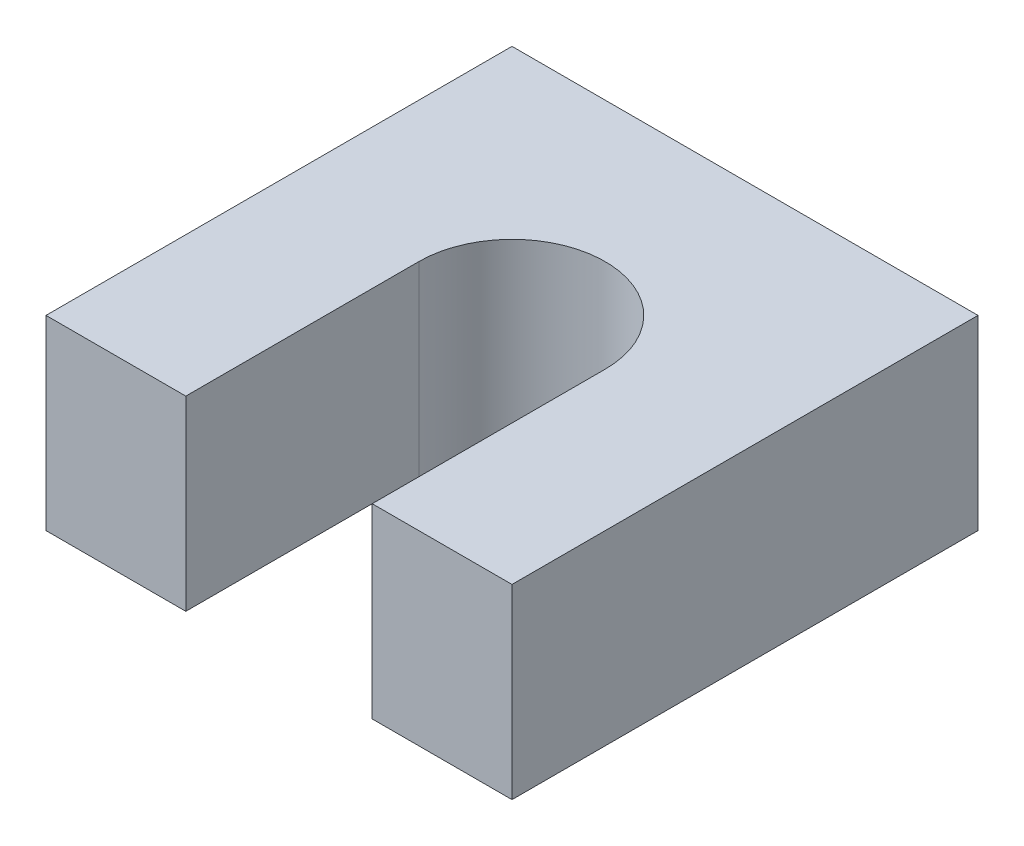
ISO-10303-21;
HEADER;
FILE_DESCRIPTION(('STEP AP214'),'2;1');
FILE_NAME('part.step','',(''),(''),'','','');
FILE_SCHEMA(('AUTOMOTIVE_DESIGN { 1 0 10303 214 1 1 1 1 }'));
ENDSEC;
DATA;
#1=APPLICATION_CONTEXT('core data for automotive mechanical design processes');
#2=APPLICATION_PROTOCOL_DEFINITION('international standard','automotive_design',2000,#1);
#3=PRODUCT_CONTEXT('',#1,'mechanical');
#4=PRODUCT('Part','Part','',(#3));
#5=PRODUCT_RELATED_PRODUCT_CATEGORY('part','',(#4));
#6=PRODUCT_DEFINITION_FORMATION('','',#4);
#7=PRODUCT_DEFINITION_CONTEXT('part definition',#1,'design');
#8=PRODUCT_DEFINITION('design','',#6,#7);
#9=PRODUCT_DEFINITION_SHAPE('','',#8);
#10=(LENGTH_UNIT() NAMED_UNIT(*) SI_UNIT(.MILLI.,.METRE.));
#11=(NAMED_UNIT(*) PLANE_ANGLE_UNIT() SI_UNIT($,.RADIAN.));
#12=(NAMED_UNIT(*) SI_UNIT($,.STERADIAN.) SOLID_ANGLE_UNIT());
#13=UNCERTAINTY_MEASURE_WITH_UNIT(LENGTH_MEASURE(1.E-05),#10,'distance_accuracy_value','');
#14=(GEOMETRIC_REPRESENTATION_CONTEXT(3) GLOBAL_UNCERTAINTY_ASSIGNED_CONTEXT((#13)) GLOBAL_UNIT_ASSIGNED_CONTEXT((#10,
#11,#12)) REPRESENTATION_CONTEXT('',''));
#15=CARTESIAN_POINT('',(0.,0.,0.));
#16=DIRECTION('',(0.,0.,1.));
#17=DIRECTION('',(1.,0.,0.));
#18=AXIS2_PLACEMENT_3D('',#15,#16,#17);
#19=CARTESIAN_POINT('',(0.,10.16,0.));
#20=DIRECTION('',(0.,-1.,0.));
#21=DIRECTION('',(0.,0.,-1.));
#22=AXIS2_PLACEMENT_3D('',#19,#20,#21);
#23=CYLINDRICAL_SURFACE('',#22,5.08);
#24=CARTESIAN_POINT('',(0.,0.,0.));
#25=DIRECTION('',(0.,1.,0.));
#26=DIRECTION('',(0.,0.,1.));
#27=AXIS2_PLACEMENT_3D('',#24,#25,#26);
#28=CIRCLE('',#27,5.08);
#29=CARTESIAN_POINT('',(5.08,0.,0.));
#30=VERTEX_POINT('',#29);
#31=CARTESIAN_POINT('',(-5.08,0.,0.));
#32=VERTEX_POINT('',#31);
#33=EDGE_CURVE('E166',#30,#32,#28,.T.);
#34=ORIENTED_EDGE('',*,*,#33,.F.);
#35=DIRECTION('',(0.,-1.,0.));
#36=VECTOR('',#35,1.);
#37=CARTESIAN_POINT('',(5.08,10.16,0.));
#38=LINE('',#37,#36);
#39=CARTESIAN_POINT('',(5.08,10.16,0.));
#40=VERTEX_POINT('',#39);
#41=EDGE_CURVE('E11',#40,#30,#38,.T.);
#42=ORIENTED_EDGE('',*,*,#41,.F.);
#43=CARTESIAN_POINT('',(0.,10.16,0.));
#44=DIRECTION('',(0.,1.,0.));
#45=DIRECTION('',(0.,0.,1.));
#46=AXIS2_PLACEMENT_3D('',#43,#44,#45);
#47=CIRCLE('',#46,5.08);
#48=CARTESIAN_POINT('',(-5.08,10.16,0.));
#49=VERTEX_POINT('',#48);
#50=EDGE_CURVE('E132',#40,#49,#47,.T.);
#51=ORIENTED_EDGE('',*,*,#50,.T.);
#52=DIRECTION('',(0.,-1.,0.));
#53=VECTOR('',#52,1.);
#54=CARTESIAN_POINT('',(-5.08,10.16,0.));
#55=LINE('',#54,#53);
#56=EDGE_CURVE('E48',#49,#32,#55,.T.);
#57=ORIENTED_EDGE('',*,*,#56,.T.);
#58=EDGE_LOOP('',(#34,#42,#51,#57));
#59=FACE_BOUND('',#58,.T.);
#60=ADVANCED_FACE('F32',(#59),#23,.F.);
#61=CARTESIAN_POINT('',(5.08,10.16,0.));
#62=DIRECTION('',(1.,0.,0.));
#63=DIRECTION('',(0.,0.,-1.));
#64=AXIS2_PLACEMENT_3D('',#61,#62,#63);
#65=PLANE('',#64);
#66=DIRECTION('',(0.,0.,1.));
#67=VECTOR('',#66,1.);
#68=CARTESIAN_POINT('',(5.08,0.,0.));
#69=LINE('',#68,#67);
#70=CARTESIAN_POINT('',(5.08,0.,12.7));
#71=VERTEX_POINT('',#70);
#72=EDGE_CURVE('E160',#30,#71,#69,.T.);
#73=ORIENTED_EDGE('',*,*,#72,.T.);
#74=DIRECTION('',(0.,-1.,0.));
#75=VECTOR('',#74,1.);
#76=CARTESIAN_POINT('',(5.08,10.16,12.7));
#77=LINE('',#76,#75);
#78=CARTESIAN_POINT('',(5.08,10.16,12.7));
#79=VERTEX_POINT('',#78);
#80=EDGE_CURVE('E40',#79,#71,#77,.T.);
#81=ORIENTED_EDGE('',*,*,#80,.F.);
#82=DIRECTION('',(0.,0.,1.));
#83=VECTOR('',#82,1.);
#84=CARTESIAN_POINT('',(5.08,10.16,0.));
#85=LINE('',#84,#83);
#86=EDGE_CURVE('E128',#40,#79,#85,.T.);
#87=ORIENTED_EDGE('',*,*,#86,.F.);
#88=ORIENTED_EDGE('',*,*,#41,.T.);
#89=EDGE_LOOP('',(#73,#81,#87,#88));
#90=FACE_BOUND('',#89,.T.);
#91=ADVANCED_FACE('F181',(#90),#65,.F.);
#92=CARTESIAN_POINT('',(0.,10.16,12.7));
#93=DIRECTION('',(0.,0.,-1.));
#94=DIRECTION('',(-1.,0.,0.));
#95=AXIS2_PLACEMENT_3D('',#92,#93,#94);
#96=PLANE('',#95);
#97=DIRECTION('',(1.,0.,0.));
#98=VECTOR('',#97,1.);
#99=CARTESIAN_POINT('',(0.,0.,12.7));
#100=LINE('',#99,#98);
#101=CARTESIAN_POINT('',(12.7,0.,12.7));
#102=VERTEX_POINT('',#101);
#103=EDGE_CURVE('E141',#71,#102,#100,.T.);
#104=ORIENTED_EDGE('',*,*,#103,.T.);
#105=DIRECTION('',(0.,-1.,0.));
#106=VECTOR('',#105,1.);
#107=CARTESIAN_POINT('',(12.7,10.16,12.7));
#108=LINE('',#107,#106);
#109=CARTESIAN_POINT('',(12.7,10.16,12.7));
#110=VERTEX_POINT('',#109);
#111=EDGE_CURVE('E150',#110,#102,#108,.T.);
#112=ORIENTED_EDGE('',*,*,#111,.F.);
#113=DIRECTION('',(1.,0.,0.));
#114=VECTOR('',#113,1.);
#115=CARTESIAN_POINT('',(0.,10.16,12.7));
#116=LINE('',#115,#114);
#117=EDGE_CURVE('E123',#79,#110,#116,.T.);
#118=ORIENTED_EDGE('',*,*,#117,.F.);
#119=ORIENTED_EDGE('',*,*,#80,.T.);
#120=EDGE_LOOP('',(#104,#112,#118,#119));
#121=FACE_BOUND('',#120,.T.);
#122=ADVANCED_FACE('F155',(#121),#96,.F.);
#123=CARTESIAN_POINT('',(12.7,10.16,0.));
#124=DIRECTION('',(1.,0.,0.));
#125=DIRECTION('',(0.,0.,-1.));
#126=AXIS2_PLACEMENT_3D('',#123,#124,#125);
#127=PLANE('',#126);
#128=DIRECTION('',(0.,0.,1.));
#129=VECTOR('',#128,1.);
#130=CARTESIAN_POINT('',(12.7,0.,0.));
#131=LINE('',#130,#129);
#132=CARTESIAN_POINT('',(12.7,0.,-12.7));
#133=VERTEX_POINT('',#132);
#134=EDGE_CURVE('E163',#133,#102,#131,.T.);
#135=ORIENTED_EDGE('',*,*,#134,.F.);
#136=DIRECTION('',(0.,-1.,0.));
#137=VECTOR('',#136,1.);
#138=CARTESIAN_POINT('',(12.7,10.16,-12.7));
#139=LINE('',#138,#137);
#140=CARTESIAN_POINT('',(12.7,10.16,-12.7));
#141=VERTEX_POINT('',#140);
#142=EDGE_CURVE('E148',#141,#133,#139,.T.);
#143=ORIENTED_EDGE('',*,*,#142,.F.);
#144=DIRECTION('',(0.,0.,1.));
#145=VECTOR('',#144,1.);
#146=CARTESIAN_POINT('',(12.7,10.16,0.));
#147=LINE('',#146,#145);
#148=EDGE_CURVE('E127',#141,#110,#147,.T.);
#149=ORIENTED_EDGE('',*,*,#148,.T.);
#150=ORIENTED_EDGE('',*,*,#111,.T.);
#151=EDGE_LOOP('',(#135,#143,#149,#150));
#152=FACE_BOUND('',#151,.T.);
#153=ADVANCED_FACE('F173',(#152),#127,.T.);
#154=CARTESIAN_POINT('',(0.,10.16,-12.7));
#155=DIRECTION('',(0.,0.,-1.));
#156=DIRECTION('',(-1.,0.,0.));
#157=AXIS2_PLACEMENT_3D('',#154,#155,#156);
#158=PLANE('',#157);
#159=DIRECTION('',(1.,0.,0.));
#160=VECTOR('',#159,1.);
#161=CARTESIAN_POINT('',(0.,0.,-12.7));
#162=LINE('',#161,#160);
#163=CARTESIAN_POINT('',(-12.7,0.,-12.7));
#164=VERTEX_POINT('',#163);
#165=EDGE_CURVE('E164',#164,#133,#162,.T.);
#166=ORIENTED_EDGE('',*,*,#165,.F.);
#167=DIRECTION('',(0.,-1.,0.));
#168=VECTOR('',#167,1.);
#169=CARTESIAN_POINT('',(-12.7,10.16,-12.7));
#170=LINE('',#169,#168);
#171=CARTESIAN_POINT('',(-12.7,10.16,-12.7));
#172=VERTEX_POINT('',#171);
#173=EDGE_CURVE('E118',#172,#164,#170,.T.);
#174=ORIENTED_EDGE('',*,*,#173,.F.);
#175=DIRECTION('',(1.,0.,0.));
#176=VECTOR('',#175,1.);
#177=CARTESIAN_POINT('',(0.,10.16,-12.7));
#178=LINE('',#177,#176);
#179=EDGE_CURVE('E108',#172,#141,#178,.T.);
#180=ORIENTED_EDGE('',*,*,#179,.T.);
#181=ORIENTED_EDGE('',*,*,#142,.T.);
#182=EDGE_LOOP('',(#166,#174,#180,#181));
#183=FACE_BOUND('',#182,.T.);
#184=ADVANCED_FACE('F171',(#183),#158,.T.);
#185=CARTESIAN_POINT('',(-12.7,10.16,0.));
#186=DIRECTION('',(1.,0.,0.));
#187=DIRECTION('',(0.,0.,-1.));
#188=AXIS2_PLACEMENT_3D('',#185,#186,#187);
#189=PLANE('',#188);
#190=DIRECTION('',(0.,0.,1.));
#191=VECTOR('',#190,1.);
#192=CARTESIAN_POINT('',(-12.7,0.,0.));
#193=LINE('',#192,#191);
#194=CARTESIAN_POINT('',(-12.7,0.,12.7));
#195=VERTEX_POINT('',#194);
#196=EDGE_CURVE('E115',#164,#195,#193,.T.);
#197=ORIENTED_EDGE('',*,*,#196,.T.);
#198=DIRECTION('',(0.,-1.,0.));
#199=VECTOR('',#198,1.);
#200=CARTESIAN_POINT('',(-12.7,10.16,12.7));
#201=LINE('',#200,#199);
#202=CARTESIAN_POINT('',(-12.7,10.16,12.7));
#203=VERTEX_POINT('',#202);
#204=EDGE_CURVE('E112',#203,#195,#201,.T.);
#205=ORIENTED_EDGE('',*,*,#204,.F.);
#206=DIRECTION('',(0.,0.,1.));
#207=VECTOR('',#206,1.);
#208=CARTESIAN_POINT('',(-12.7,10.16,0.));
#209=LINE('',#208,#207);
#210=EDGE_CURVE('E99',#172,#203,#209,.T.);
#211=ORIENTED_EDGE('',*,*,#210,.F.);
#212=ORIENTED_EDGE('',*,*,#173,.T.);
#213=EDGE_LOOP('',(#197,#205,#211,#212));
#214=FACE_BOUND('',#213,.T.);
#215=ADVANCED_FACE('F113',(#214),#189,.F.);
#216=CARTESIAN_POINT('',(-5.08,0.,12.7));
#217=VERTEX_POINT('',#216);
#218=EDGE_CURVE('E137',#195,#217,#100,.T.);
#219=ORIENTED_EDGE('',*,*,#218,.T.);
#220=DIRECTION('',(0.,-1.,0.));
#221=VECTOR('',#220,1.);
#222=CARTESIAN_POINT('',(-5.08,10.16,12.7));
#223=LINE('',#222,#221);
#224=CARTESIAN_POINT('',(-5.08,10.16,12.7));
#225=VERTEX_POINT('',#224);
#226=EDGE_CURVE('E74',#225,#217,#223,.T.);
#227=ORIENTED_EDGE('',*,*,#226,.F.);
#228=EDGE_CURVE('E105',#203,#225,#116,.T.);
#229=ORIENTED_EDGE('',*,*,#228,.F.);
#230=ORIENTED_EDGE('',*,*,#204,.T.);
#231=EDGE_LOOP('',(#219,#227,#229,#230));
#232=FACE_BOUND('',#231,.T.);
#233=ADVANCED_FACE('F120',(#232),#96,.F.);
#234=CARTESIAN_POINT('',(-5.08,10.16,0.));
#235=DIRECTION('',(1.,0.,0.));
#236=DIRECTION('',(0.,0.,-1.));
#237=AXIS2_PLACEMENT_3D('',#234,#235,#236);
#238=PLANE('',#237);
#239=DIRECTION('',(0.,0.,1.));
#240=VECTOR('',#239,1.);
#241=CARTESIAN_POINT('',(-5.08,0.,0.));
#242=LINE('',#241,#240);
#243=EDGE_CURVE('E134',#32,#217,#242,.T.);
#244=ORIENTED_EDGE('',*,*,#243,.F.);
#245=ORIENTED_EDGE('',*,*,#56,.F.);
#246=DIRECTION('',(0.,0.,1.));
#247=VECTOR('',#246,1.);
#248=CARTESIAN_POINT('',(-5.08,10.16,0.));
#249=LINE('',#248,#247);
#250=EDGE_CURVE('E121',#49,#225,#249,.T.);
#251=ORIENTED_EDGE('',*,*,#250,.T.);
#252=ORIENTED_EDGE('',*,*,#226,.T.);
#253=EDGE_LOOP('',(#244,#245,#251,#252));
#254=FACE_BOUND('',#253,.T.);
#255=ADVANCED_FACE('F188',(#254),#238,.T.);
#256=CARTESIAN_POINT('',(0.,10.16,0.));
#257=DIRECTION('',(0.,1.,0.));
#258=DIRECTION('',(0.,0.,1.));
#259=AXIS2_PLACEMENT_3D('',#256,#257,#258);
#260=PLANE('',#259);
#261=ORIENTED_EDGE('',*,*,#50,.F.);
#262=ORIENTED_EDGE('',*,*,#86,.T.);
#263=ORIENTED_EDGE('',*,*,#117,.T.);
#264=ORIENTED_EDGE('',*,*,#148,.F.);
#265=ORIENTED_EDGE('',*,*,#179,.F.);
#266=ORIENTED_EDGE('',*,*,#210,.T.);
#267=ORIENTED_EDGE('',*,*,#228,.T.);
#268=ORIENTED_EDGE('',*,*,#250,.F.);
#269=EDGE_LOOP('',(#261,#262,#263,#264,#265,#266,#267,#268));
#270=FACE_BOUND('',#269,.T.);
#271=ADVANCED_FACE('F102',(#270),#260,.T.);
#272=CARTESIAN_POINT('',(0.,0.,0.));
#273=DIRECTION('',(0.,1.,0.));
#274=DIRECTION('',(0.,0.,1.));
#275=AXIS2_PLACEMENT_3D('',#272,#273,#274);
#276=PLANE('',#275);
#277=ORIENTED_EDGE('',*,*,#33,.T.);
#278=ORIENTED_EDGE('',*,*,#243,.T.);
#279=ORIENTED_EDGE('',*,*,#218,.F.);
#280=ORIENTED_EDGE('',*,*,#196,.F.);
#281=ORIENTED_EDGE('',*,*,#165,.T.);
#282=ORIENTED_EDGE('',*,*,#134,.T.);
#283=ORIENTED_EDGE('',*,*,#103,.F.);
#284=ORIENTED_EDGE('',*,*,#72,.F.);
#285=EDGE_LOOP('',(#277,#278,#279,#280,#281,#282,#283,#284));
#286=FACE_BOUND('',#285,.T.);
#287=ADVANCED_FACE('F159',(#286),#276,.F.);
#288=CLOSED_SHELL('',(#60,#91,#122,#153,#184,#215,#233,#255,#271,#287));
#289=MANIFOLD_SOLID_BREP('B2',#288);
#290=ADVANCED_BREP_SHAPE_REPRESENTATION('',(#18,#289),#14);
#291=SHAPE_DEFINITION_REPRESENTATION(#9,#290);
ENDSEC;
END-ISO-10303-21;
